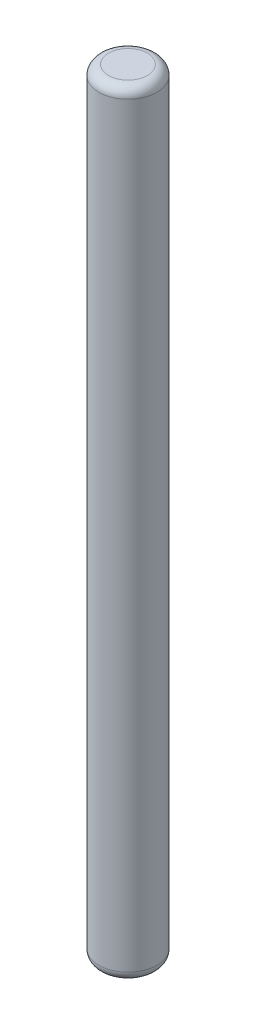
ISO-10303-21;
HEADER;
FILE_DESCRIPTION(('STEP AP214'),'2;1');
FILE_NAME('part.step','',(''),(''),'','','');
FILE_SCHEMA(('AUTOMOTIVE_DESIGN { 1 0 10303 214 1 1 1 1 }'));
ENDSEC;
DATA;
#1=APPLICATION_CONTEXT('core data for automotive mechanical design processes');
#2=APPLICATION_PROTOCOL_DEFINITION('international standard','automotive_design',2000,#1);
#3=PRODUCT_CONTEXT('',#1,'mechanical');
#4=PRODUCT('Part','Part','',(#3));
#5=PRODUCT_RELATED_PRODUCT_CATEGORY('part','',(#4));
#6=PRODUCT_DEFINITION_FORMATION('','',#4);
#7=PRODUCT_DEFINITION_CONTEXT('part definition',#1,'design');
#8=PRODUCT_DEFINITION('design','',#6,#7);
#9=PRODUCT_DEFINITION_SHAPE('','',#8);
#10=(LENGTH_UNIT() NAMED_UNIT(*) SI_UNIT(.MILLI.,.METRE.));
#11=(NAMED_UNIT(*) PLANE_ANGLE_UNIT() SI_UNIT($,.RADIAN.));
#12=(NAMED_UNIT(*) SI_UNIT($,.STERADIAN.) SOLID_ANGLE_UNIT());
#13=UNCERTAINTY_MEASURE_WITH_UNIT(LENGTH_MEASURE(1.E-05),#10,'distance_accuracy_value','');
#14=(GEOMETRIC_REPRESENTATION_CONTEXT(3) GLOBAL_UNCERTAINTY_ASSIGNED_CONTEXT((#13)) GLOBAL_UNIT_ASSIGNED_CONTEXT((#10,
#11,#12)) REPRESENTATION_CONTEXT('',''));
#15=CARTESIAN_POINT('',(0.,0.,0.));
#16=DIRECTION('',(0.,0.,1.));
#17=DIRECTION('',(1.,0.,0.));
#18=AXIS2_PLACEMENT_3D('',#15,#16,#17);
#19=CARTESIAN_POINT('',(0.,40.,0.));
#20=DIRECTION('',(0.,-1.,0.));
#21=DIRECTION('',(0.,0.,-1.));
#22=AXIS2_PLACEMENT_3D('',#19,#20,#21);
#23=CYLINDRICAL_SURFACE('',#22,1.5);
#24=CARTESIAN_POINT('',(0.,39.5,0.));
#25=DIRECTION('',(0.,1.,0.));
#26=DIRECTION('',(0.,0.,1.));
#27=AXIS2_PLACEMENT_3D('',#24,#25,#26);
#28=CIRCLE('',#27,1.5);
#29=CARTESIAN_POINT('',(0.,39.5,1.5));
#30=VERTEX_POINT('',#29);
#31=EDGE_CURVE('E37',#30,#30,#28,.F.);
#32=ORIENTED_EDGE('',*,*,#31,.T.);
#33=EDGE_LOOP('',(#32));
#34=FACE_BOUND('',#33,.T.);
#35=CARTESIAN_POINT('',(0.,0.5,0.));
#36=DIRECTION('',(0.,1.,0.));
#37=DIRECTION('',(0.,0.,1.));
#38=AXIS2_PLACEMENT_3D('',#35,#36,#37);
#39=CIRCLE('',#38,1.5);
#40=CARTESIAN_POINT('',(0.,0.5,1.5));
#41=VERTEX_POINT('',#40);
#42=EDGE_CURVE('E41',#41,#41,#39,.T.);
#43=ORIENTED_EDGE('',*,*,#42,.T.);
#44=EDGE_LOOP('',(#43));
#45=FACE_BOUND('',#44,.T.);
#46=ADVANCED_FACE('F30',(#34,#45),#23,.T.);
#47=CARTESIAN_POINT('',(0.,40.,0.));
#48=DIRECTION('',(0.,1.,0.));
#49=DIRECTION('',(0.,0.,1.));
#50=AXIS2_PLACEMENT_3D('',#47,#48,#49);
#51=PLANE('',#50);
#52=CARTESIAN_POINT('',(0.,40.,0.));
#53=DIRECTION('',(0.,1.,0.));
#54=DIRECTION('',(0.,0.,1.));
#55=AXIS2_PLACEMENT_3D('',#52,#53,#54);
#56=CIRCLE('',#55,1.);
#57=CARTESIAN_POINT('',(0.,40.,1.));
#58=VERTEX_POINT('',#57);
#59=EDGE_CURVE('E45',#58,#58,#56,.T.);
#60=ORIENTED_EDGE('',*,*,#59,.T.);
#61=EDGE_LOOP('',(#60));
#62=FACE_BOUND('',#61,.T.);
#63=ADVANCED_FACE('F51',(#62),#51,.T.);
#64=CARTESIAN_POINT('',(0.,0.,0.));
#65=DIRECTION('',(0.,1.,0.));
#66=DIRECTION('',(0.,0.,1.));
#67=AXIS2_PLACEMENT_3D('',#64,#65,#66);
#68=PLANE('',#67);
#69=CARTESIAN_POINT('',(0.,0.,0.));
#70=DIRECTION('',(0.,1.,0.));
#71=DIRECTION('',(0.,0.,1.));
#72=AXIS2_PLACEMENT_3D('',#69,#70,#71);
#73=CIRCLE('',#72,1.);
#74=CARTESIAN_POINT('',(0.,0.,1.));
#75=VERTEX_POINT('',#74);
#76=EDGE_CURVE('E10',#75,#75,#73,.F.);
#77=ORIENTED_EDGE('',*,*,#76,.T.);
#78=EDGE_LOOP('',(#77));
#79=FACE_BOUND('',#78,.T.);
#80=ADVANCED_FACE('F55',(#79),#68,.F.);
#81=CARTESIAN_POINT('',(0.,39.5,0.));
#82=DIRECTION('',(0.,1.,0.));
#83=DIRECTION('',(0.,0.,1.));
#84=AXIS2_PLACEMENT_3D('',#81,#82,#83);
#85=TOROIDAL_SURFACE('',#84,1.,0.5);
#86=ORIENTED_EDGE('',*,*,#31,.F.);
#87=EDGE_LOOP('',(#86));
#88=FACE_BOUND('',#87,.T.);
#89=ORIENTED_EDGE('',*,*,#59,.F.);
#90=EDGE_LOOP('',(#89));
#91=FACE_BOUND('',#90,.T.);
#92=ADVANCED_FACE('F53',(#88,#91),#85,.T.);
#93=CARTESIAN_POINT('',(0.,0.5,0.));
#94=DIRECTION('',(0.,1.,0.));
#95=DIRECTION('',(0.,0.,1.));
#96=AXIS2_PLACEMENT_3D('',#93,#94,#95);
#97=TOROIDAL_SURFACE('',#96,1.,0.5);
#98=ORIENTED_EDGE('',*,*,#76,.F.);
#99=EDGE_LOOP('',(#98));
#100=FACE_BOUND('',#99,.T.);
#101=ORIENTED_EDGE('',*,*,#42,.F.);
#102=EDGE_LOOP('',(#101));
#103=FACE_BOUND('',#102,.T.);
#104=ADVANCED_FACE('F32',(#100,#103),#97,.T.);
#105=CLOSED_SHELL('',(#46,#63,#80,#92,#104));
#106=MANIFOLD_SOLID_BREP('B2',#105);
#107=ADVANCED_BREP_SHAPE_REPRESENTATION('',(#18,#106),#14);
#108=SHAPE_DEFINITION_REPRESENTATION(#9,#107);
ENDSEC;
END-ISO-10303-21;
